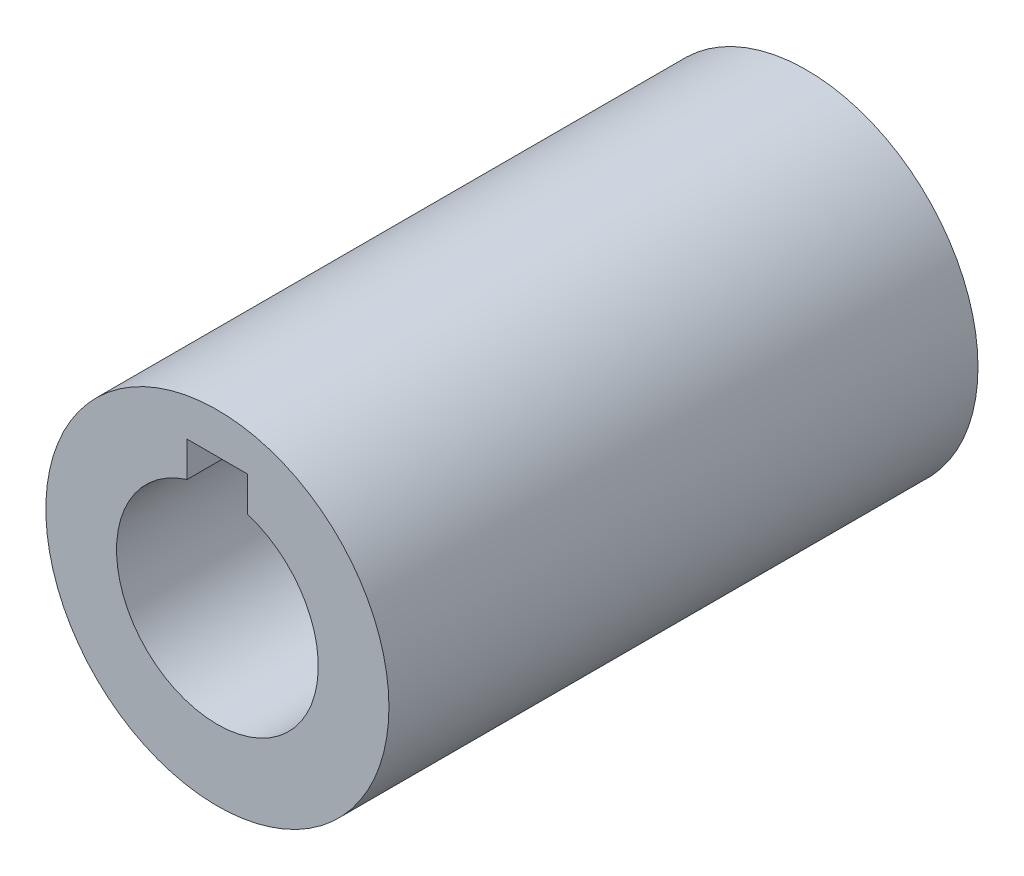
ISO-10303-21;
HEADER;
FILE_DESCRIPTION(('STEP AP214'),'2;1');
FILE_NAME('part.step','',(''),(''),'','','');
FILE_SCHEMA(('AUTOMOTIVE_DESIGN { 1 0 10303 214 1 1 1 1 }'));
ENDSEC;
DATA;
#1=APPLICATION_CONTEXT('core data for automotive mechanical design processes');
#2=APPLICATION_PROTOCOL_DEFINITION('international standard','automotive_design',2000,#1);
#3=PRODUCT_CONTEXT('',#1,'mechanical');
#4=PRODUCT('Part','Part','',(#3));
#5=PRODUCT_RELATED_PRODUCT_CATEGORY('part','',(#4));
#6=PRODUCT_DEFINITION_FORMATION('','',#4);
#7=PRODUCT_DEFINITION_CONTEXT('part definition',#1,'design');
#8=PRODUCT_DEFINITION('design','',#6,#7);
#9=PRODUCT_DEFINITION_SHAPE('','',#8);
#10=(LENGTH_UNIT() NAMED_UNIT(*) SI_UNIT(.MILLI.,.METRE.));
#11=(NAMED_UNIT(*) PLANE_ANGLE_UNIT() SI_UNIT($,.RADIAN.));
#12=(NAMED_UNIT(*) SI_UNIT($,.STERADIAN.) SOLID_ANGLE_UNIT());
#13=UNCERTAINTY_MEASURE_WITH_UNIT(LENGTH_MEASURE(1.E-05),#10,'distance_accuracy_value','');
#14=(GEOMETRIC_REPRESENTATION_CONTEXT(3) GLOBAL_UNCERTAINTY_ASSIGNED_CONTEXT((#13)) GLOBAL_UNIT_ASSIGNED_CONTEXT((#10,
#11,#12)) REPRESENTATION_CONTEXT('',''));
#15=CARTESIAN_POINT('',(0.,0.,0.));
#16=DIRECTION('',(0.,0.,1.));
#17=DIRECTION('',(1.,0.,0.));
#18=AXIS2_PLACEMENT_3D('',#15,#16,#17);
#19=CARTESIAN_POINT('',(0.,0.,46.355));
#20=DIRECTION('',(0.,0.,1.));
#21=DIRECTION('',(1.,0.,0.));
#22=AXIS2_PLACEMENT_3D('',#19,#20,#21);
#23=CYLINDRICAL_SURFACE('',#22,13.5);
#24=CARTESIAN_POINT('',(0.,0.,0.));
#25=DIRECTION('',(0.,0.,1.));
#26=DIRECTION('',(1.,0.,0.));
#27=AXIS2_PLACEMENT_3D('',#24,#25,#26);
#28=CIRCLE('',#27,13.5);
#29=CARTESIAN_POINT('',(13.5,0.,0.));
#30=VERTEX_POINT('',#29);
#31=EDGE_CURVE('E93',#30,#30,#28,.F.);
#32=ORIENTED_EDGE('',*,*,#31,.F.);
#33=EDGE_LOOP('',(#32));
#34=FACE_BOUND('',#33,.T.);
#35=CARTESIAN_POINT('',(0.,0.,46.355));
#36=DIRECTION('',(0.,0.,1.));
#37=DIRECTION('',(1.,0.,0.));
#38=AXIS2_PLACEMENT_3D('',#35,#36,#37);
#39=CIRCLE('',#38,13.5);
#40=CARTESIAN_POINT('',(13.5,0.,46.355));
#41=VERTEX_POINT('',#40);
#42=EDGE_CURVE('E20',#41,#41,#39,.T.);
#43=ORIENTED_EDGE('',*,*,#42,.F.);
#44=EDGE_LOOP('',(#43));
#45=FACE_BOUND('',#44,.T.);
#46=ADVANCED_FACE('F16',(#34,#45),#23,.T.);
#47=CARTESIAN_POINT('',(2.38125,7.43454953180935,-2.31775));
#48=DIRECTION('',(-1.,0.,0.));
#49=DIRECTION('',(0.,0.,1.));
#50=AXIS2_PLACEMENT_3D('',#47,#48,#49);
#51=PLANE('',#50);
#52=DIRECTION('',(0.,1.,0.));
#53=VECTOR('',#52,1.);
#54=CARTESIAN_POINT('',(2.38125,-14.85,0.));
#55=LINE('',#54,#53);
#56=CARTESIAN_POINT('',(2.38125,7.571892411247,0.));
#57=VERTEX_POINT('',#56);
#58=CARTESIAN_POINT('',(2.38125,10.31875,0.));
#59=VERTEX_POINT('',#58);
#60=EDGE_CURVE('E87',#57,#59,#55,.T.);
#61=ORIENTED_EDGE('',*,*,#60,.F.);
#62=DIRECTION('',(0.,0.,-1.));
#63=VECTOR('',#62,1.);
#64=CARTESIAN_POINT('',(2.38124999999999,7.571892411247,23.1775));
#65=LINE('',#64,#63);
#66=CARTESIAN_POINT('',(2.38125,7.571892411247,46.355));
#67=VERTEX_POINT('',#66);
#68=EDGE_CURVE('E66',#67,#57,#65,.T.);
#69=ORIENTED_EDGE('',*,*,#68,.F.);
#70=DIRECTION('',(0.,1.,0.));
#71=VECTOR('',#70,1.);
#72=CARTESIAN_POINT('',(2.38125,-14.85,46.355));
#73=LINE('',#72,#71);
#74=CARTESIAN_POINT('',(2.38125,10.31875,46.355));
#75=VERTEX_POINT('',#74);
#76=EDGE_CURVE('E63',#75,#67,#73,.F.);
#77=ORIENTED_EDGE('',*,*,#76,.F.);
#78=DIRECTION('',(0.,0.,-1.));
#79=VECTOR('',#78,1.);
#80=CARTESIAN_POINT('',(2.38125,10.31875,48.67275));
#81=LINE('',#80,#79);
#82=EDGE_CURVE('E75',#59,#75,#81,.F.);
#83=ORIENTED_EDGE('',*,*,#82,.F.);
#84=EDGE_LOOP('',(#61,#69,#77,#83));
#85=FACE_BOUND('',#84,.T.);
#86=ADVANCED_FACE('F102',(#85),#51,.T.);
#87=CARTESIAN_POINT('',(-14.85,-14.85,46.355));
#88=DIRECTION('',(0.,0.,1.));
#89=DIRECTION('',(1.,0.,0.));
#90=AXIS2_PLACEMENT_3D('',#87,#88,#89);
#91=PLANE('',#90);
#92=ORIENTED_EDGE('',*,*,#76,.T.);
#93=CARTESIAN_POINT('',(0.,0.,46.355));
#94=DIRECTION('',(0.,0.,1.));
#95=DIRECTION('',(1.,0.,0.));
#96=AXIS2_PLACEMENT_3D('',#93,#94,#95);
#97=CIRCLE('',#96,7.93749999999999);
#98=CARTESIAN_POINT('',(-2.38125,7.57189241124701,46.355));
#99=VERTEX_POINT('',#98);
#100=EDGE_CURVE('E55',#99,#67,#97,.T.);
#101=ORIENTED_EDGE('',*,*,#100,.F.);
#102=DIRECTION('',(0.,1.,0.));
#103=VECTOR('',#102,1.);
#104=CARTESIAN_POINT('',(-2.38125,7.43454953180935,46.355));
#105=LINE('',#104,#103);
#106=CARTESIAN_POINT('',(-2.38125,10.31875,46.355));
#107=VERTEX_POINT('',#106);
#108=EDGE_CURVE('E61',#107,#99,#105,.F.);
#109=ORIENTED_EDGE('',*,*,#108,.F.);
#110=DIRECTION('',(1.,0.,0.));
#111=VECTOR('',#110,1.);
#112=CARTESIAN_POINT('',(-2.619375,10.31875,46.355));
#113=LINE('',#112,#111);
#114=EDGE_CURVE('E85',#75,#107,#113,.F.);
#115=ORIENTED_EDGE('',*,*,#114,.F.);
#116=EDGE_LOOP('',(#92,#101,#109,#115));
#117=FACE_BOUND('',#116,.T.);
#118=ORIENTED_EDGE('',*,*,#42,.T.);
#119=EDGE_LOOP('',(#118));
#120=FACE_BOUND('',#119,.T.);
#121=ADVANCED_FACE('F57',(#117,#120),#91,.T.);
#122=CARTESIAN_POINT('',(0.,0.,0.));
#123=DIRECTION('',(0.,0.,1.));
#124=DIRECTION('',(1.,0.,0.));
#125=AXIS2_PLACEMENT_3D('',#122,#123,#124);
#126=CYLINDRICAL_SURFACE('',#125,7.93749999999999);
#127=CARTESIAN_POINT('',(0.,0.,0.));
#128=DIRECTION('',(0.,0.,1.));
#129=DIRECTION('',(1.,0.,0.));
#130=AXIS2_PLACEMENT_3D('',#127,#128,#129);
#131=CIRCLE('',#130,7.93749999999999);
#132=CARTESIAN_POINT('',(-2.38125,7.57189241124701,0.));
#133=VERTEX_POINT('',#132);
#134=EDGE_CURVE('E71',#133,#57,#131,.T.);
#135=ORIENTED_EDGE('',*,*,#134,.F.);
#136=DIRECTION('',(0.,0.,-1.));
#137=VECTOR('',#136,1.);
#138=CARTESIAN_POINT('',(-2.38125,7.57189241124702,48.67275));
#139=LINE('',#138,#137);
#140=EDGE_CURVE('E68',#99,#133,#139,.T.);
#141=ORIENTED_EDGE('',*,*,#140,.F.);
#142=ORIENTED_EDGE('',*,*,#100,.T.);
#143=ORIENTED_EDGE('',*,*,#68,.T.);
#144=EDGE_LOOP('',(#135,#141,#142,#143));
#145=FACE_BOUND('',#144,.T.);
#146=ADVANCED_FACE('F69',(#145),#126,.F.);
#147=CARTESIAN_POINT('',(14.85,-14.85,0.));
#148=DIRECTION('',(0.,0.,-1.));
#149=DIRECTION('',(-1.,0.,0.));
#150=AXIS2_PLACEMENT_3D('',#147,#148,#149);
#151=PLANE('',#150);
#152=ORIENTED_EDGE('',*,*,#60,.T.);
#153=DIRECTION('',(1.,0.,0.));
#154=VECTOR('',#153,1.);
#155=CARTESIAN_POINT('',(-2.619375,10.31875,0.));
#156=LINE('',#155,#154);
#157=CARTESIAN_POINT('',(-2.38125,10.31875,0.));
#158=VERTEX_POINT('',#157);
#159=EDGE_CURVE('E35',#158,#59,#156,.T.);
#160=ORIENTED_EDGE('',*,*,#159,.F.);
#161=DIRECTION('',(0.,1.,0.));
#162=VECTOR('',#161,1.);
#163=CARTESIAN_POINT('',(-2.38125,7.43454953180935,0.));
#164=LINE('',#163,#162);
#165=EDGE_CURVE('E26',#133,#158,#164,.T.);
#166=ORIENTED_EDGE('',*,*,#165,.F.);
#167=ORIENTED_EDGE('',*,*,#134,.T.);
#168=EDGE_LOOP('',(#152,#160,#166,#167));
#169=FACE_BOUND('',#168,.T.);
#170=ORIENTED_EDGE('',*,*,#31,.T.);
#171=EDGE_LOOP('',(#170));
#172=FACE_BOUND('',#171,.T.);
#173=ADVANCED_FACE('F98',(#169,#172),#151,.T.);
#174=CARTESIAN_POINT('',(-2.619375,10.31875,48.67275));
#175=DIRECTION('',(0.,-1.,0.));
#176=DIRECTION('',(0.,0.,-1.));
#177=AXIS2_PLACEMENT_3D('',#174,#175,#176);
#178=PLANE('',#177);
#179=ORIENTED_EDGE('',*,*,#159,.T.);
#180=ORIENTED_EDGE('',*,*,#82,.T.);
#181=ORIENTED_EDGE('',*,*,#114,.T.);
#182=DIRECTION('',(0.,0.,-1.));
#183=VECTOR('',#182,1.);
#184=CARTESIAN_POINT('',(-2.38125,10.31875,48.67275));
#185=LINE('',#184,#183);
#186=EDGE_CURVE('E11',#158,#107,#185,.F.);
#187=ORIENTED_EDGE('',*,*,#186,.F.);
#188=EDGE_LOOP('',(#179,#180,#181,#187));
#189=FACE_BOUND('',#188,.T.);
#190=ADVANCED_FACE('F118',(#189),#178,.T.);
#191=CARTESIAN_POINT('',(-2.38125,7.43454953180935,48.67275));
#192=DIRECTION('',(1.,0.,0.));
#193=DIRECTION('',(0.,0.,-1.));
#194=AXIS2_PLACEMENT_3D('',#191,#192,#193);
#195=PLANE('',#194);
#196=ORIENTED_EDGE('',*,*,#165,.T.);
#197=ORIENTED_EDGE('',*,*,#186,.T.);
#198=ORIENTED_EDGE('',*,*,#108,.T.);
#199=ORIENTED_EDGE('',*,*,#140,.T.);
#200=EDGE_LOOP('',(#196,#197,#198,#199));
#201=FACE_BOUND('',#200,.T.);
#202=ADVANCED_FACE('F18',(#201),#195,.T.);
#203=CLOSED_SHELL('',(#46,#86,#121,#146,#173,#190,#202));
#204=MANIFOLD_SOLID_BREP('B1',#203);
#205=ADVANCED_BREP_SHAPE_REPRESENTATION('',(#18,#204),#14);
#206=SHAPE_DEFINITION_REPRESENTATION(#9,#205);
ENDSEC;
END-ISO-10303-21;
